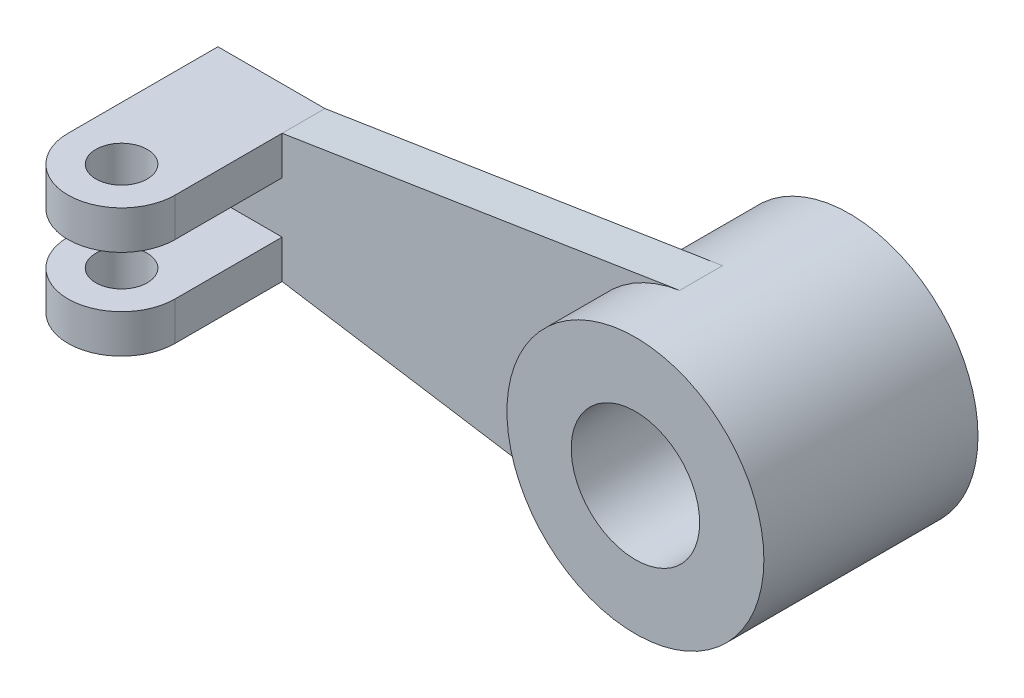
ISO-10303-21;
HEADER;
FILE_DESCRIPTION(('STEP AP214'),'2;1');
FILE_NAME('part.step','',(''),(''),'','','');
FILE_SCHEMA(('AUTOMOTIVE_DESIGN { 1 0 10303 214 1 1 1 1 }'));
ENDSEC;
DATA;
#1=APPLICATION_CONTEXT('core data for automotive mechanical design processes');
#2=APPLICATION_PROTOCOL_DEFINITION('international standard','automotive_design',2000,#1);
#3=PRODUCT_CONTEXT('',#1,'mechanical');
#4=PRODUCT('Part','Part','',(#3));
#5=PRODUCT_RELATED_PRODUCT_CATEGORY('part','',(#4));
#6=PRODUCT_DEFINITION_FORMATION('','',#4);
#7=PRODUCT_DEFINITION_CONTEXT('part definition',#1,'design');
#8=PRODUCT_DEFINITION('design','',#6,#7);
#9=PRODUCT_DEFINITION_SHAPE('','',#8);
#10=(LENGTH_UNIT() NAMED_UNIT(*) SI_UNIT(.MILLI.,.METRE.));
#11=(NAMED_UNIT(*) PLANE_ANGLE_UNIT() SI_UNIT($,.RADIAN.));
#12=(NAMED_UNIT(*) SI_UNIT($,.STERADIAN.) SOLID_ANGLE_UNIT());
#13=UNCERTAINTY_MEASURE_WITH_UNIT(LENGTH_MEASURE(1.E-05),#10,'distance_accuracy_value','');
#14=(GEOMETRIC_REPRESENTATION_CONTEXT(3) GLOBAL_UNCERTAINTY_ASSIGNED_CONTEXT((#13)) GLOBAL_UNIT_ASSIGNED_CONTEXT((#10,
#11,#12)) REPRESENTATION_CONTEXT('',''));
#15=CARTESIAN_POINT('',(0.,0.,0.));
#16=DIRECTION('',(0.,0.,1.));
#17=DIRECTION('',(1.,0.,0.));
#18=AXIS2_PLACEMENT_3D('',#15,#16,#17);
#19=CARTESIAN_POINT('',(0.,0.,25.));
#20=DIRECTION('',(0.,0.,-1.));
#21=DIRECTION('',(-1.,0.,0.));
#22=AXIS2_PLACEMENT_3D('',#19,#20,#21);
#23=CYLINDRICAL_SURFACE('',#22,30.);
#24=DIRECTION('',(0.,0.,-1.));
#25=VECTOR('',#24,1.);
#26=CARTESIAN_POINT('',(-4.67168875625145,29.6340230843656,10.));
#27=LINE('',#26,#25);
#28=CARTESIAN_POINT('',(-4.67168875625144,29.6340230843656,10.));
#29=VERTEX_POINT('',#28);
#30=CARTESIAN_POINT('',(-4.67168875625144,29.6340230843656,0.));
#31=VERTEX_POINT('',#30);
#32=EDGE_CURVE('E54',#29,#31,#27,.T.);
#33=ORIENTED_EDGE('',*,*,#32,.F.);
#34=CARTESIAN_POINT('',(0.,0.,10.));
#35=DIRECTION('',(0.,0.,1.));
#36=DIRECTION('',(1.,0.,0.));
#37=AXIS2_PLACEMENT_3D('',#34,#35,#36);
#38=CIRCLE('',#37,30.);
#39=CARTESIAN_POINT('',(-4.67168875625144,-29.6340230843656,10.));
#40=VERTEX_POINT('',#39);
#41=EDGE_CURVE('E191',#29,#40,#38,.T.);
#42=ORIENTED_EDGE('',*,*,#41,.T.);
#43=DIRECTION('',(0.,0.,-1.));
#44=VECTOR('',#43,1.);
#45=CARTESIAN_POINT('',(-4.67168875625144,-29.6340230843656,10.));
#46=LINE('',#45,#44);
#47=CARTESIAN_POINT('',(-4.67168875625144,-29.6340230843656,0.));
#48=VERTEX_POINT('',#47);
#49=EDGE_CURVE('E209',#40,#48,#46,.T.);
#50=ORIENTED_EDGE('',*,*,#49,.T.);
#51=CARTESIAN_POINT('',(0.,0.,0.));
#52=DIRECTION('',(0.,0.,1.));
#53=DIRECTION('',(1.,0.,0.));
#54=AXIS2_PLACEMENT_3D('',#51,#52,#53);
#55=CIRCLE('',#54,30.);
#56=EDGE_CURVE('E186',#31,#48,#55,.T.);
#57=ORIENTED_EDGE('',*,*,#56,.F.);
#58=EDGE_LOOP('',(#33,#42,#50,#57));
#59=FACE_BOUND('',#58,.T.);
#60=CARTESIAN_POINT('',(0.,0.,25.));
#61=DIRECTION('',(0.,0.,1.));
#62=DIRECTION('',(1.,0.,0.));
#63=AXIS2_PLACEMENT_3D('',#60,#61,#62);
#64=CIRCLE('',#63,30.);
#65=CARTESIAN_POINT('',(30.,0.,25.));
#66=VERTEX_POINT('',#65);
#67=EDGE_CURVE('E11',#66,#66,#64,.T.);
#68=ORIENTED_EDGE('',*,*,#67,.F.);
#69=EDGE_LOOP('',(#68));
#70=FACE_BOUND('',#69,.T.);
#71=CARTESIAN_POINT('',(0.,0.,-25.));
#72=DIRECTION('',(0.,0.,1.));
#73=DIRECTION('',(1.,0.,0.));
#74=AXIS2_PLACEMENT_3D('',#71,#72,#73);
#75=CIRCLE('',#74,30.);
#76=CARTESIAN_POINT('',(30.,0.,-25.));
#77=VERTEX_POINT('',#76);
#78=EDGE_CURVE('E35',#77,#77,#75,.T.);
#79=ORIENTED_EDGE('',*,*,#78,.T.);
#80=EDGE_LOOP('',(#79));
#81=FACE_BOUND('',#80,.T.);
#82=ADVANCED_FACE('F32',(#59,#70,#81),#23,.T.);
#83=CARTESIAN_POINT('',(0.,0.,25.));
#84=DIRECTION('',(0.,0.,1.));
#85=DIRECTION('',(1.,0.,0.));
#86=AXIS2_PLACEMENT_3D('',#83,#84,#85);
#87=PLANE('',#86);
#88=CARTESIAN_POINT('',(0.,0.,25.));
#89=DIRECTION('',(0.,0.,1.));
#90=DIRECTION('',(1.,0.,0.));
#91=AXIS2_PLACEMENT_3D('',#88,#89,#90);
#92=CIRCLE('',#91,15.);
#93=CARTESIAN_POINT('',(15.,0.,25.));
#94=VERTEX_POINT('',#93);
#95=EDGE_CURVE('E221',#94,#94,#92,.T.);
#96=ORIENTED_EDGE('',*,*,#95,.F.);
#97=EDGE_LOOP('',(#96));
#98=FACE_BOUND('',#97,.T.);
#99=ORIENTED_EDGE('',*,*,#67,.T.);
#100=EDGE_LOOP('',(#99));
#101=FACE_BOUND('',#100,.T.);
#102=ADVANCED_FACE('F230',(#98,#101),#87,.T.);
#103=CARTESIAN_POINT('',(0.,0.,-25.));
#104=DIRECTION('',(0.,0.,1.));
#105=DIRECTION('',(1.,0.,0.));
#106=AXIS2_PLACEMENT_3D('',#103,#104,#105);
#107=PLANE('',#106);
#108=CARTESIAN_POINT('',(0.,0.,-25.));
#109=DIRECTION('',(0.,0.,1.));
#110=DIRECTION('',(1.,0.,0.));
#111=AXIS2_PLACEMENT_3D('',#108,#109,#110);
#112=CIRCLE('',#111,15.);
#113=CARTESIAN_POINT('',(15.,0.,-25.));
#114=VERTEX_POINT('',#113);
#115=EDGE_CURVE('E222',#114,#114,#112,.T.);
#116=ORIENTED_EDGE('',*,*,#115,.T.);
#117=EDGE_LOOP('',(#116));
#118=FACE_BOUND('',#117,.T.);
#119=ORIENTED_EDGE('',*,*,#78,.F.);
#120=EDGE_LOOP('',(#119));
#121=FACE_BOUND('',#120,.T.);
#122=ADVANCED_FACE('F233',(#118,#121),#107,.F.);
#123=CARTESIAN_POINT('',(0.,0.,-25.));
#124=DIRECTION('',(0.,0.,1.));
#125=DIRECTION('',(1.,0.,0.));
#126=AXIS2_PLACEMENT_3D('',#123,#124,#125);
#127=CYLINDRICAL_SURFACE('',#126,15.);
#128=ORIENTED_EDGE('',*,*,#115,.F.);
#129=EDGE_LOOP('',(#128));
#130=FACE_BOUND('',#129,.T.);
#131=ORIENTED_EDGE('',*,*,#95,.T.);
#132=EDGE_LOOP('',(#131));
#133=FACE_BOUND('',#132,.T.);
#134=ADVANCED_FACE('F228',(#130,#133),#127,.F.);
#135=CARTESIAN_POINT('',(-4.67168875625144,29.6340230843656,10.));
#136=DIRECTION('',(0.155722958541715,-0.987800769478854,0.));
#137=DIRECTION('',(0.987800769478854,0.155722958541715,0.));
#138=AXIS2_PLACEMENT_3D('',#135,#136,#137);
#139=PLANE('',#138);
#140=DIRECTION('',(-0.987800769478854,-0.155722958541715,0.));
#141=VECTOR('',#140,1.);
#142=CARTESIAN_POINT('',(-4.67168875625144,29.6340230843656,0.));
#143=LINE('',#142,#141);
#144=CARTESIAN_POINT('',(-97.5,15.,0.));
#145=VERTEX_POINT('',#144);
#146=EDGE_CURVE('E176',#31,#145,#143,.T.);
#147=ORIENTED_EDGE('',*,*,#146,.T.);
#148=DIRECTION('',(0.,0.,-1.));
#149=VECTOR('',#148,1.);
#150=CARTESIAN_POINT('',(-97.5,15.,10.));
#151=LINE('',#150,#149);
#152=CARTESIAN_POINT('',(-97.5,15.,10.));
#153=VERTEX_POINT('',#152);
#154=EDGE_CURVE('E218',#153,#145,#151,.T.);
#155=ORIENTED_EDGE('',*,*,#154,.F.);
#156=DIRECTION('',(-0.987800769478854,-0.155722958541715,0.));
#157=VECTOR('',#156,1.);
#158=CARTESIAN_POINT('',(-4.67168875625144,29.6340230843656,10.));
#159=LINE('',#158,#157);
#160=EDGE_CURVE('E182',#29,#153,#159,.T.);
#161=ORIENTED_EDGE('',*,*,#160,.F.);
#162=ORIENTED_EDGE('',*,*,#32,.T.);
#163=EDGE_LOOP('',(#147,#155,#161,#162));
#164=FACE_BOUND('',#163,.T.);
#165=ADVANCED_FACE('F247',(#164),#139,.F.);
#166=CARTESIAN_POINT('',(-97.5,15.,10.));
#167=DIRECTION('',(0.,-1.,0.));
#168=DIRECTION('',(1.,0.,0.));
#169=AXIS2_PLACEMENT_3D('',#166,#167,#168);
#170=PLANE('',#169);
#171=DIRECTION('',(-1.,0.,0.));
#172=VECTOR('',#171,1.);
#173=CARTESIAN_POINT('',(-97.5,15.,0.));
#174=LINE('',#173,#172);
#175=CARTESIAN_POINT('',(-122.5,15.,0.));
#176=VERTEX_POINT('',#175);
#177=EDGE_CURVE('E195',#145,#176,#174,.T.);
#178=ORIENTED_EDGE('',*,*,#177,.T.);
#179=DIRECTION('',(0.,0.,-1.));
#180=VECTOR('',#179,1.);
#181=CARTESIAN_POINT('',(-122.5,15.,10.));
#182=LINE('',#181,#180);
#183=CARTESIAN_POINT('',(-122.5,15.,35.));
#184=VERTEX_POINT('',#183);
#185=EDGE_CURVE('E215',#184,#176,#182,.T.);
#186=ORIENTED_EDGE('',*,*,#185,.F.);
#187=CARTESIAN_POINT('',(-110.,15.,35.));
#188=DIRECTION('',(0.,-1.,0.));
#189=DIRECTION('',(-1.,0.,0.));
#190=AXIS2_PLACEMENT_3D('',#187,#188,#189);
#191=CIRCLE('',#190,12.5);
#192=CARTESIAN_POINT('',(-97.5,15.,35.));
#193=VERTEX_POINT('',#192);
#194=EDGE_CURVE('E137',#193,#184,#191,.T.);
#195=ORIENTED_EDGE('',*,*,#194,.F.);
#196=DIRECTION('',(0.,0.,1.));
#197=VECTOR('',#196,1.);
#198=CARTESIAN_POINT('',(-97.5,15.,10.));
#199=LINE('',#198,#197);
#200=EDGE_CURVE('E126',#153,#193,#199,.T.);
#201=ORIENTED_EDGE('',*,*,#200,.F.);
#202=ORIENTED_EDGE('',*,*,#154,.T.);
#203=EDGE_LOOP('',(#178,#186,#195,#201,#202));
#204=FACE_BOUND('',#203,.T.);
#205=CARTESIAN_POINT('',(-110.,15.,35.));
#206=DIRECTION('',(0.,-1.,0.));
#207=DIRECTION('',(1.,0.,0.));
#208=AXIS2_PLACEMENT_3D('',#205,#206,#207);
#209=CIRCLE('',#208,6.);
#210=CARTESIAN_POINT('',(-104.,15.,35.));
#211=VERTEX_POINT('',#210);
#212=EDGE_CURVE('E140',#211,#211,#209,.T.);
#213=ORIENTED_EDGE('',*,*,#212,.T.);
#214=EDGE_LOOP('',(#213));
#215=FACE_BOUND('',#214,.T.);
#216=ADVANCED_FACE('F253',(#204,#215),#170,.F.);
#217=CARTESIAN_POINT('',(-122.5,15.,10.));
#218=DIRECTION('',(1.,0.,0.));
#219=DIRECTION('',(0.,0.,-1.));
#220=AXIS2_PLACEMENT_3D('',#217,#218,#219);
#221=PLANE('',#220);
#222=DIRECTION('',(0.,-1.,0.));
#223=VECTOR('',#222,1.);
#224=CARTESIAN_POINT('',(-122.5,15.,0.));
#225=LINE('',#224,#223);
#226=CARTESIAN_POINT('',(-122.5,-15.,0.));
#227=VERTEX_POINT('',#226);
#228=EDGE_CURVE('E197',#176,#227,#225,.T.);
#229=ORIENTED_EDGE('',*,*,#228,.T.);
#230=DIRECTION('',(0.,0.,-1.));
#231=VECTOR('',#230,1.);
#232=CARTESIAN_POINT('',(-122.5,-15.,10.));
#233=LINE('',#232,#231);
#234=CARTESIAN_POINT('',(-122.5,-15.,35.));
#235=VERTEX_POINT('',#234);
#236=EDGE_CURVE('E213',#235,#227,#233,.T.);
#237=ORIENTED_EDGE('',*,*,#236,.F.);
#238=DIRECTION('',(0.,-1.,0.));
#239=VECTOR('',#238,1.);
#240=CARTESIAN_POINT('',(-122.5,-6.,35.));
#241=LINE('',#240,#239);
#242=CARTESIAN_POINT('',(-122.5,-6.,35.));
#243=VERTEX_POINT('',#242);
#244=EDGE_CURVE('E169',#243,#235,#241,.T.);
#245=ORIENTED_EDGE('',*,*,#244,.F.);
#246=DIRECTION('',(0.,0.,-1.));
#247=VECTOR('',#246,1.);
#248=CARTESIAN_POINT('',(-122.5,-6.,10.));
#249=LINE('',#248,#247);
#250=CARTESIAN_POINT('',(-122.5,-6.,10.));
#251=VERTEX_POINT('',#250);
#252=EDGE_CURVE('E159',#243,#251,#249,.T.);
#253=ORIENTED_EDGE('',*,*,#252,.T.);
#254=DIRECTION('',(0.,-1.,0.));
#255=VECTOR('',#254,1.);
#256=CARTESIAN_POINT('',(-122.5,15.,10.));
#257=LINE('',#256,#255);
#258=CARTESIAN_POINT('',(-122.5,6.,10.));
#259=VERTEX_POINT('',#258);
#260=EDGE_CURVE('E185',#259,#251,#257,.T.);
#261=ORIENTED_EDGE('',*,*,#260,.F.);
#262=DIRECTION('',(0.,0.,-1.));
#263=VECTOR('',#262,1.);
#264=CARTESIAN_POINT('',(-122.5,6.,10.));
#265=LINE('',#264,#263);
#266=CARTESIAN_POINT('',(-122.5,6.,35.));
#267=VERTEX_POINT('',#266);
#268=EDGE_CURVE('E131',#267,#259,#265,.T.);
#269=ORIENTED_EDGE('',*,*,#268,.F.);
#270=DIRECTION('',(0.,1.,0.));
#271=VECTOR('',#270,1.);
#272=CARTESIAN_POINT('',(-122.5,6.,35.));
#273=LINE('',#272,#271);
#274=EDGE_CURVE('E135',#267,#184,#273,.T.);
#275=ORIENTED_EDGE('',*,*,#274,.T.);
#276=ORIENTED_EDGE('',*,*,#185,.T.);
#277=EDGE_LOOP('',(#229,#237,#245,#253,#261,#269,#275,#276));
#278=FACE_BOUND('',#277,.T.);
#279=ADVANCED_FACE('F257',(#278),#221,.F.);
#280=CARTESIAN_POINT('',(-97.5,-15.,10.));
#281=DIRECTION('',(0.,-1.,0.));
#282=DIRECTION('',(1.,0.,0.));
#283=AXIS2_PLACEMENT_3D('',#280,#281,#282);
#284=PLANE('',#283);
#285=DIRECTION('',(-1.,0.,0.));
#286=VECTOR('',#285,1.);
#287=CARTESIAN_POINT('',(-97.5,-15.,0.));
#288=LINE('',#287,#286);
#289=CARTESIAN_POINT('',(-97.5,-15.,0.));
#290=VERTEX_POINT('',#289);
#291=EDGE_CURVE('E200',#290,#227,#288,.T.);
#292=ORIENTED_EDGE('',*,*,#291,.F.);
#293=DIRECTION('',(0.,0.,-1.));
#294=VECTOR('',#293,1.);
#295=CARTESIAN_POINT('',(-97.5,-15.,10.));
#296=LINE('',#295,#294);
#297=CARTESIAN_POINT('',(-97.5,-15.,10.));
#298=VERTEX_POINT('',#297);
#299=EDGE_CURVE('E211',#298,#290,#296,.T.);
#300=ORIENTED_EDGE('',*,*,#299,.F.);
#301=DIRECTION('',(0.,0.,1.));
#302=VECTOR('',#301,1.);
#303=CARTESIAN_POINT('',(-97.5,-15.,10.));
#304=LINE('',#303,#302);
#305=CARTESIAN_POINT('',(-97.5,-15.,35.));
#306=VERTEX_POINT('',#305);
#307=EDGE_CURVE('E160',#298,#306,#304,.T.);
#308=ORIENTED_EDGE('',*,*,#307,.T.);
#309=CARTESIAN_POINT('',(-110.,-15.,35.));
#310=DIRECTION('',(0.,-1.,0.));
#311=DIRECTION('',(-1.,0.,0.));
#312=AXIS2_PLACEMENT_3D('',#309,#310,#311);
#313=CIRCLE('',#312,12.5);
#314=EDGE_CURVE('E153',#306,#235,#313,.T.);
#315=ORIENTED_EDGE('',*,*,#314,.T.);
#316=ORIENTED_EDGE('',*,*,#236,.T.);
#317=EDGE_LOOP('',(#292,#300,#308,#315,#316));
#318=FACE_BOUND('',#317,.T.);
#319=CARTESIAN_POINT('',(-110.,-15.,35.));
#320=DIRECTION('',(0.,-1.,0.));
#321=DIRECTION('',(1.,0.,0.));
#322=AXIS2_PLACEMENT_3D('',#319,#320,#321);
#323=CIRCLE('',#322,6.);
#324=CARTESIAN_POINT('',(-104.,-15.,35.));
#325=VERTEX_POINT('',#324);
#326=EDGE_CURVE('E148',#325,#325,#323,.T.);
#327=ORIENTED_EDGE('',*,*,#326,.F.);
#328=EDGE_LOOP('',(#327));
#329=FACE_BOUND('',#328,.T.);
#330=ADVANCED_FACE('F261',(#318,#329),#284,.T.);
#331=CARTESIAN_POINT('',(-4.67168875625144,-29.6340230843656,10.));
#332=DIRECTION('',(-0.155722958541715,-0.987800769478854,0.));
#333=DIRECTION('',(0.987800769478854,-0.155722958541715,0.));
#334=AXIS2_PLACEMENT_3D('',#331,#332,#333);
#335=PLANE('',#334);
#336=DIRECTION('',(-0.987800769478854,0.155722958541715,0.));
#337=VECTOR('',#336,1.);
#338=CARTESIAN_POINT('',(-4.67168875625144,-29.6340230843656,0.));
#339=LINE('',#338,#337);
#340=EDGE_CURVE('E203',#48,#290,#339,.T.);
#341=ORIENTED_EDGE('',*,*,#340,.F.);
#342=ORIENTED_EDGE('',*,*,#49,.F.);
#343=DIRECTION('',(-0.987800769478854,0.155722958541715,0.));
#344=VECTOR('',#343,1.);
#345=CARTESIAN_POINT('',(-4.67168875625144,-29.6340230843656,10.));
#346=LINE('',#345,#344);
#347=EDGE_CURVE('E188',#40,#298,#346,.T.);
#348=ORIENTED_EDGE('',*,*,#347,.T.);
#349=ORIENTED_EDGE('',*,*,#299,.T.);
#350=EDGE_LOOP('',(#341,#342,#348,#349));
#351=FACE_BOUND('',#350,.T.);
#352=ADVANCED_FACE('F265',(#351),#335,.T.);
#353=CARTESIAN_POINT('',(0.,0.,10.));
#354=DIRECTION('',(0.,0.,1.));
#355=DIRECTION('',(1.,0.,0.));
#356=AXIS2_PLACEMENT_3D('',#353,#354,#355);
#357=PLANE('',#356);
#358=DIRECTION('',(1.,0.,0.));
#359=VECTOR('',#358,1.);
#360=CARTESIAN_POINT('',(-122.5,6.,10.));
#361=LINE('',#360,#359);
#362=CARTESIAN_POINT('',(-97.5,6.,10.));
#363=VERTEX_POINT('',#362);
#364=EDGE_CURVE('E119',#259,#363,#361,.T.);
#365=ORIENTED_EDGE('',*,*,#364,.F.);
#366=ORIENTED_EDGE('',*,*,#260,.T.);
#367=DIRECTION('',(1.,0.,0.));
#368=VECTOR('',#367,1.);
#369=CARTESIAN_POINT('',(-122.5,-6.,10.));
#370=LINE('',#369,#368);
#371=CARTESIAN_POINT('',(-97.5,-6.,10.));
#372=VERTEX_POINT('',#371);
#373=EDGE_CURVE('E163',#251,#372,#370,.T.);
#374=ORIENTED_EDGE('',*,*,#373,.T.);
#375=DIRECTION('',(0.,-1.,0.));
#376=VECTOR('',#375,1.);
#377=CARTESIAN_POINT('',(-97.5,-6.,10.));
#378=LINE('',#377,#376);
#379=EDGE_CURVE('E177',#372,#298,#378,.T.);
#380=ORIENTED_EDGE('',*,*,#379,.T.);
#381=ORIENTED_EDGE('',*,*,#347,.F.);
#382=ORIENTED_EDGE('',*,*,#41,.F.);
#383=ORIENTED_EDGE('',*,*,#160,.T.);
#384=DIRECTION('',(0.,1.,0.));
#385=VECTOR('',#384,1.);
#386=CARTESIAN_POINT('',(-97.5,6.,10.));
#387=LINE('',#386,#385);
#388=EDGE_CURVE('E130',#363,#153,#387,.T.);
#389=ORIENTED_EDGE('',*,*,#388,.F.);
#390=EDGE_LOOP('',(#365,#366,#374,#380,#381,#382,#383,#389));
#391=FACE_BOUND('',#390,.T.);
#392=ADVANCED_FACE('F269',(#391),#357,.T.);
#393=CARTESIAN_POINT('',(0.,0.,0.));
#394=DIRECTION('',(0.,0.,1.));
#395=DIRECTION('',(1.,0.,0.));
#396=AXIS2_PLACEMENT_3D('',#393,#394,#395);
#397=PLANE('',#396);
#398=ORIENTED_EDGE('',*,*,#146,.F.);
#399=ORIENTED_EDGE('',*,*,#56,.T.);
#400=ORIENTED_EDGE('',*,*,#340,.T.);
#401=ORIENTED_EDGE('',*,*,#291,.T.);
#402=ORIENTED_EDGE('',*,*,#228,.F.);
#403=ORIENTED_EDGE('',*,*,#177,.F.);
#404=EDGE_LOOP('',(#398,#399,#400,#401,#402,#403));
#405=FACE_BOUND('',#404,.T.);
#406=ADVANCED_FACE('F271',(#405),#397,.F.);
#407=CARTESIAN_POINT('',(-110.,-6.,35.));
#408=DIRECTION('',(0.,-1.,0.));
#409=DIRECTION('',(1.,0.,0.));
#410=AXIS2_PLACEMENT_3D('',#407,#408,#409);
#411=CYLINDRICAL_SURFACE('',#410,12.5);
#412=ORIENTED_EDGE('',*,*,#314,.F.);
#413=DIRECTION('',(0.,-1.,0.));
#414=VECTOR('',#413,1.);
#415=CARTESIAN_POINT('',(-97.5,-6.,35.));
#416=LINE('',#415,#414);
#417=CARTESIAN_POINT('',(-97.5,-6.,35.));
#418=VERTEX_POINT('',#417);
#419=EDGE_CURVE('E174',#418,#306,#416,.T.);
#420=ORIENTED_EDGE('',*,*,#419,.F.);
#421=CARTESIAN_POINT('',(-110.,-6.,35.));
#422=DIRECTION('',(0.,-1.,0.));
#423=DIRECTION('',(-1.,0.,0.));
#424=AXIS2_PLACEMENT_3D('',#421,#422,#423);
#425=CIRCLE('',#424,12.5);
#426=EDGE_CURVE('E156',#418,#243,#425,.T.);
#427=ORIENTED_EDGE('',*,*,#426,.T.);
#428=ORIENTED_EDGE('',*,*,#244,.T.);
#429=EDGE_LOOP('',(#412,#420,#427,#428));
#430=FACE_BOUND('',#429,.T.);
#431=ADVANCED_FACE('F274',(#430),#411,.T.);
#432=CARTESIAN_POINT('',(-97.5,-6.,10.));
#433=DIRECTION('',(1.,0.,0.));
#434=DIRECTION('',(0.,1.,0.));
#435=AXIS2_PLACEMENT_3D('',#432,#433,#434);
#436=PLANE('',#435);
#437=ORIENTED_EDGE('',*,*,#307,.F.);
#438=ORIENTED_EDGE('',*,*,#379,.F.);
#439=DIRECTION('',(0.,0.,1.));
#440=VECTOR('',#439,1.);
#441=CARTESIAN_POINT('',(-97.5,-6.,10.));
#442=LINE('',#441,#440);
#443=EDGE_CURVE('E166',#372,#418,#442,.T.);
#444=ORIENTED_EDGE('',*,*,#443,.T.);
#445=ORIENTED_EDGE('',*,*,#419,.T.);
#446=EDGE_LOOP('',(#437,#438,#444,#445));
#447=FACE_BOUND('',#446,.T.);
#448=ADVANCED_FACE('F281',(#447),#436,.T.);
#449=CARTESIAN_POINT('',(-110.,-6.,35.));
#450=DIRECTION('',(0.,1.,0.));
#451=DIRECTION('',(-1.,0.,0.));
#452=AXIS2_PLACEMENT_3D('',#449,#450,#451);
#453=PLANE('',#452);
#454=CARTESIAN_POINT('',(-110.,-6.,35.));
#455=DIRECTION('',(0.,-1.,0.));
#456=DIRECTION('',(1.,0.,0.));
#457=AXIS2_PLACEMENT_3D('',#454,#455,#456);
#458=CIRCLE('',#457,6.);
#459=CARTESIAN_POINT('',(-104.,-6.,35.));
#460=VERTEX_POINT('',#459);
#461=EDGE_CURVE('E150',#460,#460,#458,.T.);
#462=ORIENTED_EDGE('',*,*,#461,.T.);
#463=EDGE_LOOP('',(#462));
#464=FACE_BOUND('',#463,.T.);
#465=ORIENTED_EDGE('',*,*,#426,.F.);
#466=ORIENTED_EDGE('',*,*,#443,.F.);
#467=ORIENTED_EDGE('',*,*,#373,.F.);
#468=ORIENTED_EDGE('',*,*,#252,.F.);
#469=EDGE_LOOP('',(#465,#466,#467,#468));
#470=FACE_BOUND('',#469,.T.);
#471=ADVANCED_FACE('F285',(#464,#470),#453,.T.);
#472=CARTESIAN_POINT('',(-110.,-6.,35.));
#473=DIRECTION('',(0.,-1.,0.));
#474=DIRECTION('',(1.,0.,0.));
#475=AXIS2_PLACEMENT_3D('',#472,#473,#474);
#476=CYLINDRICAL_SURFACE('',#475,6.);
#477=ORIENTED_EDGE('',*,*,#461,.F.);
#478=EDGE_LOOP('',(#477));
#479=FACE_BOUND('',#478,.T.);
#480=ORIENTED_EDGE('',*,*,#326,.T.);
#481=EDGE_LOOP('',(#480));
#482=FACE_BOUND('',#481,.T.);
#483=ADVANCED_FACE('F289',(#479,#482),#476,.F.);
#484=CARTESIAN_POINT('',(-110.,6.,35.));
#485=DIRECTION('',(0.,-1.,0.));
#486=DIRECTION('',(-1.,0.,0.));
#487=AXIS2_PLACEMENT_3D('',#484,#485,#486);
#488=PLANE('',#487);
#489=CARTESIAN_POINT('',(-110.,6.,35.));
#490=DIRECTION('',(0.,-1.,0.));
#491=DIRECTION('',(-1.,0.,0.));
#492=AXIS2_PLACEMENT_3D('',#489,#490,#491);
#493=CIRCLE('',#492,12.5);
#494=CARTESIAN_POINT('',(-97.5,6.,35.));
#495=VERTEX_POINT('',#494);
#496=EDGE_CURVE('E116',#495,#267,#493,.T.);
#497=ORIENTED_EDGE('',*,*,#496,.T.);
#498=ORIENTED_EDGE('',*,*,#268,.T.);
#499=ORIENTED_EDGE('',*,*,#364,.T.);
#500=DIRECTION('',(0.,0.,1.));
#501=VECTOR('',#500,1.);
#502=CARTESIAN_POINT('',(-97.5,6.,10.));
#503=LINE('',#502,#501);
#504=EDGE_CURVE('E46',#363,#495,#503,.T.);
#505=ORIENTED_EDGE('',*,*,#504,.T.);
#506=EDGE_LOOP('',(#497,#498,#499,#505));
#507=FACE_BOUND('',#506,.T.);
#508=CARTESIAN_POINT('',(-110.,6.,35.));
#509=DIRECTION('',(0.,-1.,0.));
#510=DIRECTION('',(1.,0.,0.));
#511=AXIS2_PLACEMENT_3D('',#508,#509,#510);
#512=CIRCLE('',#511,6.);
#513=CARTESIAN_POINT('',(-104.,6.,35.));
#514=VERTEX_POINT('',#513);
#515=EDGE_CURVE('E145',#514,#514,#512,.T.);
#516=ORIENTED_EDGE('',*,*,#515,.F.);
#517=EDGE_LOOP('',(#516));
#518=FACE_BOUND('',#517,.T.);
#519=ADVANCED_FACE('F113',(#507,#518),#488,.T.);
#520=CARTESIAN_POINT('',(-110.,6.,35.));
#521=DIRECTION('',(0.,1.,0.));
#522=DIRECTION('',(-1.,0.,0.));
#523=AXIS2_PLACEMENT_3D('',#520,#521,#522);
#524=CYLINDRICAL_SURFACE('',#523,12.5);
#525=ORIENTED_EDGE('',*,*,#194,.T.);
#526=ORIENTED_EDGE('',*,*,#274,.F.);
#527=ORIENTED_EDGE('',*,*,#496,.F.);
#528=DIRECTION('',(0.,1.,0.));
#529=VECTOR('',#528,1.);
#530=CARTESIAN_POINT('',(-97.5,6.,35.));
#531=LINE('',#530,#529);
#532=EDGE_CURVE('E123',#495,#193,#531,.T.);
#533=ORIENTED_EDGE('',*,*,#532,.T.);
#534=EDGE_LOOP('',(#525,#526,#527,#533));
#535=FACE_BOUND('',#534,.T.);
#536=ADVANCED_FACE('F133',(#535),#524,.T.);
#537=CARTESIAN_POINT('',(-97.5,6.,10.));
#538=DIRECTION('',(-1.,0.,0.));
#539=DIRECTION('',(0.,-1.,0.));
#540=AXIS2_PLACEMENT_3D('',#537,#538,#539);
#541=PLANE('',#540);
#542=ORIENTED_EDGE('',*,*,#200,.T.);
#543=ORIENTED_EDGE('',*,*,#532,.F.);
#544=ORIENTED_EDGE('',*,*,#504,.F.);
#545=ORIENTED_EDGE('',*,*,#388,.T.);
#546=EDGE_LOOP('',(#542,#543,#544,#545));
#547=FACE_BOUND('',#546,.T.);
#548=ADVANCED_FACE('F124',(#547),#541,.F.);
#549=CARTESIAN_POINT('',(-110.,6.,35.));
#550=DIRECTION('',(0.,1.,0.));
#551=DIRECTION('',(-1.,0.,0.));
#552=AXIS2_PLACEMENT_3D('',#549,#550,#551);
#553=CYLINDRICAL_SURFACE('',#552,6.);
#554=ORIENTED_EDGE('',*,*,#515,.T.);
#555=EDGE_LOOP('',(#554));
#556=FACE_BOUND('',#555,.T.);
#557=ORIENTED_EDGE('',*,*,#212,.F.);
#558=EDGE_LOOP('',(#557));
#559=FACE_BOUND('',#558,.T.);
#560=ADVANCED_FACE('F298',(#556,#559),#553,.F.);
#561=CLOSED_SHELL('',(#82,#102,#122,#134,#165,#216,#279,#330,#352,#392,#406,#431,#448,#471,#483,
#519,#536,#548,#560));
#562=MANIFOLD_SOLID_BREP('B2',#561);
#563=ADVANCED_BREP_SHAPE_REPRESENTATION('',(#18,#562),#14);
#564=SHAPE_DEFINITION_REPRESENTATION(#9,#563);
ENDSEC;
END-ISO-10303-21;
